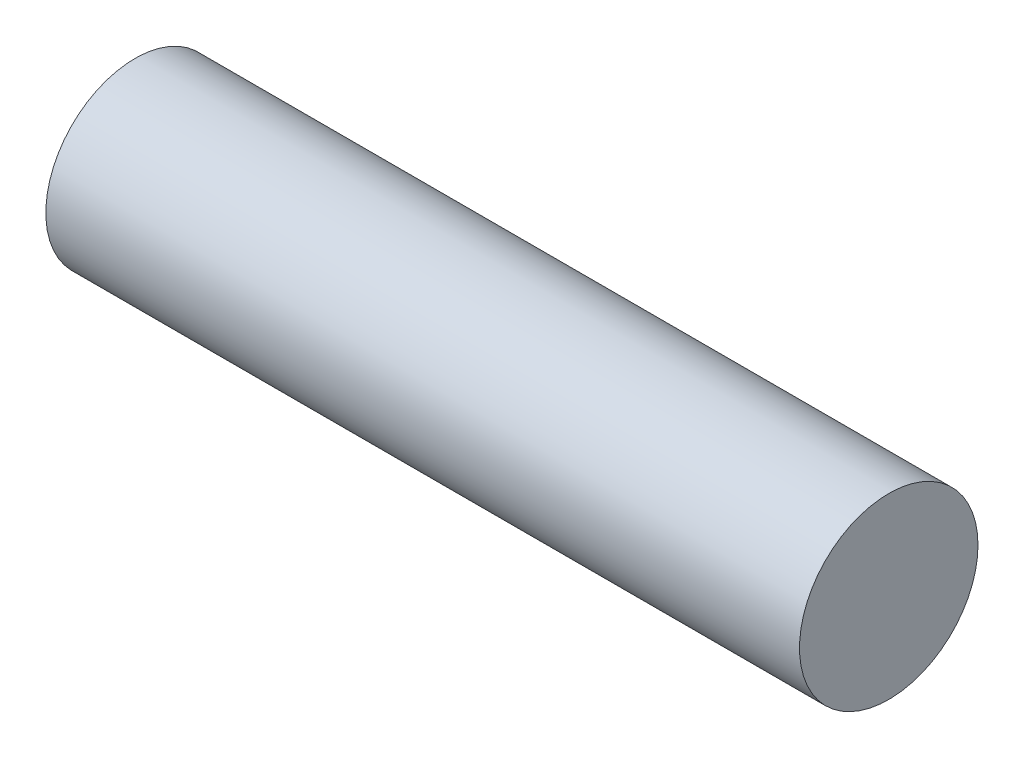
ISO-10303-21;
HEADER;
FILE_DESCRIPTION(('STEP AP214'),'2;1');
FILE_NAME('part.step','',(''),(''),'','','');
FILE_SCHEMA(('AUTOMOTIVE_DESIGN { 1 0 10303 214 1 1 1 1 }'));
ENDSEC;
DATA;
#1=APPLICATION_CONTEXT('core data for automotive mechanical design processes');
#2=APPLICATION_PROTOCOL_DEFINITION('international standard','automotive_design',2000,#1);
#3=PRODUCT_CONTEXT('',#1,'mechanical');
#4=PRODUCT('Part','Part','',(#3));
#5=PRODUCT_RELATED_PRODUCT_CATEGORY('part','',(#4));
#6=PRODUCT_DEFINITION_FORMATION('','',#4);
#7=PRODUCT_DEFINITION_CONTEXT('part definition',#1,'design');
#8=PRODUCT_DEFINITION('design','',#6,#7);
#9=PRODUCT_DEFINITION_SHAPE('','',#8);
#10=(LENGTH_UNIT() NAMED_UNIT(*) SI_UNIT(.MILLI.,.METRE.));
#11=(NAMED_UNIT(*) PLANE_ANGLE_UNIT() SI_UNIT($,.RADIAN.));
#12=(NAMED_UNIT(*) SI_UNIT($,.STERADIAN.) SOLID_ANGLE_UNIT());
#13=UNCERTAINTY_MEASURE_WITH_UNIT(LENGTH_MEASURE(1.E-05),#10,'distance_accuracy_value','');
#14=(GEOMETRIC_REPRESENTATION_CONTEXT(3) GLOBAL_UNCERTAINTY_ASSIGNED_CONTEXT((#13)) GLOBAL_UNIT_ASSIGNED_CONTEXT((#10,
#11,#12)) REPRESENTATION_CONTEXT('',''));
#15=CARTESIAN_POINT('',(0.,0.,0.));
#16=DIRECTION('',(0.,0.,1.));
#17=DIRECTION('',(1.,0.,0.));
#18=AXIS2_PLACEMENT_3D('',#15,#16,#17);
#19=CARTESIAN_POINT('',(38.,0.,0.));
#20=DIRECTION('',(-1.,0.,0.));
#21=DIRECTION('',(0.,0.,1.));
#22=AXIS2_PLACEMENT_3D('',#19,#20,#21);
#23=CYLINDRICAL_SURFACE('',#22,9.);
#24=CARTESIAN_POINT('',(38.,0.,0.));
#25=DIRECTION('',(1.,0.,0.));
#26=DIRECTION('',(0.,0.,-1.));
#27=AXIS2_PLACEMENT_3D('',#24,#25,#26);
#28=CIRCLE('',#27,9.);
#29=CARTESIAN_POINT('',(38.,0.,-9.));
#30=VERTEX_POINT('',#29);
#31=EDGE_CURVE('E10',#30,#30,#28,.T.);
#32=ORIENTED_EDGE('',*,*,#31,.F.);
#33=EDGE_LOOP('',(#32));
#34=FACE_BOUND('',#33,.T.);
#35=CARTESIAN_POINT('',(-38.,0.,0.));
#36=DIRECTION('',(1.,0.,0.));
#37=DIRECTION('',(0.,0.,-1.));
#38=AXIS2_PLACEMENT_3D('',#35,#36,#37);
#39=CIRCLE('',#38,9.);
#40=CARTESIAN_POINT('',(-38.,0.,-9.));
#41=VERTEX_POINT('',#40);
#42=EDGE_CURVE('E37',#41,#41,#39,.T.);
#43=ORIENTED_EDGE('',*,*,#42,.T.);
#44=EDGE_LOOP('',(#43));
#45=FACE_BOUND('',#44,.T.);
#46=ADVANCED_FACE('F34',(#34,#45),#23,.T.);
#47=CARTESIAN_POINT('',(38.,0.,0.));
#48=DIRECTION('',(1.,0.,0.));
#49=DIRECTION('',(0.,0.,-1.));
#50=AXIS2_PLACEMENT_3D('',#47,#48,#49);
#51=PLANE('',#50);
#52=ORIENTED_EDGE('',*,*,#31,.T.);
#53=EDGE_LOOP('',(#52));
#54=FACE_BOUND('',#53,.T.);
#55=ADVANCED_FACE('F49',(#54),#51,.T.);
#56=CARTESIAN_POINT('',(-38.,0.,0.));
#57=DIRECTION('',(1.,0.,0.));
#58=DIRECTION('',(0.,0.,-1.));
#59=AXIS2_PLACEMENT_3D('',#56,#57,#58);
#60=PLANE('',#59);
#61=ORIENTED_EDGE('',*,*,#42,.F.);
#62=EDGE_LOOP('',(#61));
#63=FACE_BOUND('',#62,.T.);
#64=ADVANCED_FACE('F47',(#63),#60,.F.);
#65=CLOSED_SHELL('',(#46,#55,#64));
#66=MANIFOLD_SOLID_BREP('B2',#65);
#67=ADVANCED_BREP_SHAPE_REPRESENTATION('',(#18,#66),#14);
#68=SHAPE_DEFINITION_REPRESENTATION(#9,#67);
ENDSEC;
END-ISO-10303-21;
